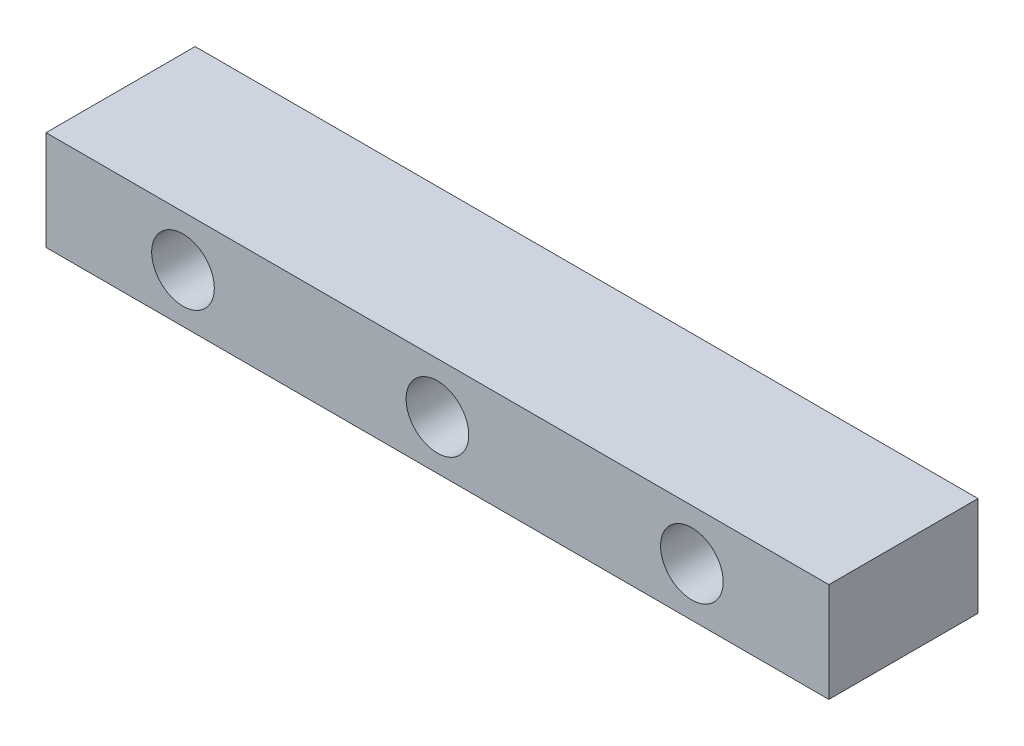
ISO-10303-21;
HEADER;
FILE_DESCRIPTION(('STEP AP214'),'2;1');
FILE_NAME('part.step','',(''),(''),'','','');
FILE_SCHEMA(('AUTOMOTIVE_DESIGN { 1 0 10303 214 1 1 1 1 }'));
ENDSEC;
DATA;
#1=APPLICATION_CONTEXT('core data for automotive mechanical design processes');
#2=APPLICATION_PROTOCOL_DEFINITION('international standard','automotive_design',2000,#1);
#3=PRODUCT_CONTEXT('',#1,'mechanical');
#4=PRODUCT('Part','Part','',(#3));
#5=PRODUCT_RELATED_PRODUCT_CATEGORY('part','',(#4));
#6=PRODUCT_DEFINITION_FORMATION('','',#4);
#7=PRODUCT_DEFINITION_CONTEXT('part definition',#1,'design');
#8=PRODUCT_DEFINITION('design','',#6,#7);
#9=PRODUCT_DEFINITION_SHAPE('','',#8);
#10=(LENGTH_UNIT() NAMED_UNIT(*) SI_UNIT(.MILLI.,.METRE.));
#11=(NAMED_UNIT(*) PLANE_ANGLE_UNIT() SI_UNIT($,.RADIAN.));
#12=(NAMED_UNIT(*) SI_UNIT($,.STERADIAN.) SOLID_ANGLE_UNIT());
#13=UNCERTAINTY_MEASURE_WITH_UNIT(LENGTH_MEASURE(1.E-05),#10,'distance_accuracy_value','');
#14=(GEOMETRIC_REPRESENTATION_CONTEXT(3) GLOBAL_UNCERTAINTY_ASSIGNED_CONTEXT((#13)) GLOBAL_UNIT_ASSIGNED_CONTEXT((#10,
#11,#12)) REPRESENTATION_CONTEXT('',''));
#15=CARTESIAN_POINT('',(0.,0.,0.));
#16=DIRECTION('',(0.,0.,1.));
#17=DIRECTION('',(1.,0.,0.));
#18=AXIS2_PLACEMENT_3D('',#15,#16,#17);
#19=CARTESIAN_POINT('',(0.,50.8,0.));
#20=DIRECTION('',(1.,0.,0.));
#21=DIRECTION('',(0.,0.,-1.));
#22=AXIS2_PLACEMENT_3D('',#19,#20,#21);
#23=PLANE('',#22);
#24=DIRECTION('',(0.,0.,1.));
#25=VECTOR('',#24,1.);
#26=CARTESIAN_POINT('',(0.,0.,0.));
#27=LINE('',#26,#25);
#28=CARTESIAN_POINT('',(0.,0.,-76.2));
#29=VERTEX_POINT('',#28);
#30=CARTESIAN_POINT('',(0.,0.,0.));
#31=VERTEX_POINT('',#30);
#32=EDGE_CURVE('E96',#29,#31,#27,.T.);
#33=ORIENTED_EDGE('',*,*,#32,.T.);
#34=DIRECTION('',(0.,-1.,0.));
#35=VECTOR('',#34,1.);
#36=CARTESIAN_POINT('',(0.,50.8,0.));
#37=LINE('',#36,#35);
#38=CARTESIAN_POINT('',(0.,50.8,0.));
#39=VERTEX_POINT('',#38);
#40=EDGE_CURVE('E11',#39,#31,#37,.T.);
#41=ORIENTED_EDGE('',*,*,#40,.F.);
#42=DIRECTION('',(0.,0.,1.));
#43=VECTOR('',#42,1.);
#44=CARTESIAN_POINT('',(0.,50.8,0.));
#45=LINE('',#44,#43);
#46=CARTESIAN_POINT('',(0.,50.8,-76.2));
#47=VERTEX_POINT('',#46);
#48=EDGE_CURVE('E84',#47,#39,#45,.T.);
#49=ORIENTED_EDGE('',*,*,#48,.F.);
#50=DIRECTION('',(0.,-1.,0.));
#51=VECTOR('',#50,1.);
#52=CARTESIAN_POINT('',(0.,50.8,-76.2));
#53=LINE('',#52,#51);
#54=EDGE_CURVE('E92',#47,#29,#53,.T.);
#55=ORIENTED_EDGE('',*,*,#54,.T.);
#56=EDGE_LOOP('',(#33,#41,#49,#55));
#57=FACE_BOUND('',#56,.T.);
#58=ADVANCED_FACE('F33',(#57),#23,.F.);
#59=CARTESIAN_POINT('',(0.,50.8,0.));
#60=DIRECTION('',(0.,0.,-1.));
#61=DIRECTION('',(-1.,0.,0.));
#62=AXIS2_PLACEMENT_3D('',#59,#60,#61);
#63=PLANE('',#62);
#64=CARTESIAN_POINT('',(330.,25.,0.));
#65=DIRECTION('',(0.,0.,1.));
#66=DIRECTION('',(1.,0.,0.));
#67=AXIS2_PLACEMENT_3D('',#64,#65,#66);
#68=CIRCLE('',#67,16.);
#69=CARTESIAN_POINT('',(346.,25.,0.));
#70=VERTEX_POINT('',#69);
#71=EDGE_CURVE('E119',#70,#70,#68,.T.);
#72=ORIENTED_EDGE('',*,*,#71,.F.);
#73=EDGE_LOOP('',(#72));
#74=FACE_BOUND('',#73,.T.);
#75=CARTESIAN_POINT('',(200.,25.,0.));
#76=DIRECTION('',(0.,0.,1.));
#77=DIRECTION('',(1.,0.,0.));
#78=AXIS2_PLACEMENT_3D('',#75,#76,#77);
#79=CIRCLE('',#78,16.);
#80=CARTESIAN_POINT('',(216.,25.,0.));
#81=VERTEX_POINT('',#80);
#82=EDGE_CURVE('E113',#81,#81,#79,.T.);
#83=ORIENTED_EDGE('',*,*,#82,.F.);
#84=EDGE_LOOP('',(#83));
#85=FACE_BOUND('',#84,.T.);
#86=CARTESIAN_POINT('',(70.,25.,0.));
#87=DIRECTION('',(0.,0.,1.));
#88=DIRECTION('',(1.,0.,0.));
#89=AXIS2_PLACEMENT_3D('',#86,#87,#88);
#90=CIRCLE('',#89,16.);
#91=CARTESIAN_POINT('',(86.,25.,0.));
#92=VERTEX_POINT('',#91);
#93=EDGE_CURVE('E110',#92,#92,#90,.T.);
#94=ORIENTED_EDGE('',*,*,#93,.F.);
#95=EDGE_LOOP('',(#94));
#96=FACE_BOUND('',#95,.T.);
#97=DIRECTION('',(1.,0.,0.));
#98=VECTOR('',#97,1.);
#99=CARTESIAN_POINT('',(0.,0.,0.));
#100=LINE('',#99,#98);
#101=CARTESIAN_POINT('',(400.,0.,0.));
#102=VERTEX_POINT('',#101);
#103=EDGE_CURVE('E88',#31,#102,#100,.T.);
#104=ORIENTED_EDGE('',*,*,#103,.T.);
#105=DIRECTION('',(0.,-1.,0.));
#106=VECTOR('',#105,1.);
#107=CARTESIAN_POINT('',(400.,50.8,0.));
#108=LINE('',#107,#106);
#109=CARTESIAN_POINT('',(400.,50.8,0.));
#110=VERTEX_POINT('',#109);
#111=EDGE_CURVE('E41',#110,#102,#108,.T.);
#112=ORIENTED_EDGE('',*,*,#111,.F.);
#113=DIRECTION('',(1.,0.,0.));
#114=VECTOR('',#113,1.);
#115=CARTESIAN_POINT('',(0.,50.8,0.));
#116=LINE('',#115,#114);
#117=EDGE_CURVE('E79',#39,#110,#116,.T.);
#118=ORIENTED_EDGE('',*,*,#117,.F.);
#119=ORIENTED_EDGE('',*,*,#40,.T.);
#120=EDGE_LOOP('',(#104,#112,#118,#119));
#121=FACE_BOUND('',#120,.T.);
#122=ADVANCED_FACE('F87',(#74,#85,#96,#121),#63,.F.);
#123=CARTESIAN_POINT('',(400.,50.8,0.));
#124=DIRECTION('',(-1.,0.,0.));
#125=DIRECTION('',(0.,0.,1.));
#126=AXIS2_PLACEMENT_3D('',#123,#124,#125);
#127=PLANE('',#126);
#128=DIRECTION('',(0.,0.,-1.));
#129=VECTOR('',#128,1.);
#130=CARTESIAN_POINT('',(400.,0.,0.));
#131=LINE('',#130,#129);
#132=CARTESIAN_POINT('',(400.,0.,-76.2));
#133=VERTEX_POINT('',#132);
#134=EDGE_CURVE('E66',#102,#133,#131,.T.);
#135=ORIENTED_EDGE('',*,*,#134,.T.);
#136=DIRECTION('',(0.,-1.,0.));
#137=VECTOR('',#136,1.);
#138=CARTESIAN_POINT('',(400.,50.8,-76.2));
#139=LINE('',#138,#137);
#140=CARTESIAN_POINT('',(400.,50.8,-76.2));
#141=VERTEX_POINT('',#140);
#142=EDGE_CURVE('E89',#141,#133,#139,.T.);
#143=ORIENTED_EDGE('',*,*,#142,.F.);
#144=DIRECTION('',(0.,0.,-1.));
#145=VECTOR('',#144,1.);
#146=CARTESIAN_POINT('',(400.,50.8,0.));
#147=LINE('',#146,#145);
#148=EDGE_CURVE('E82',#110,#141,#147,.T.);
#149=ORIENTED_EDGE('',*,*,#148,.F.);
#150=ORIENTED_EDGE('',*,*,#111,.T.);
#151=EDGE_LOOP('',(#135,#143,#149,#150));
#152=FACE_BOUND('',#151,.T.);
#153=ADVANCED_FACE('F90',(#152),#127,.F.);
#154=CARTESIAN_POINT('',(0.,50.8,-76.2));
#155=DIRECTION('',(0.,0.,1.));
#156=DIRECTION('',(1.,0.,0.));
#157=AXIS2_PLACEMENT_3D('',#154,#155,#156);
#158=PLANE('',#157);
#159=CARTESIAN_POINT('',(330.,25.,-76.2));
#160=DIRECTION('',(0.,0.,1.));
#161=DIRECTION('',(1.,0.,0.));
#162=AXIS2_PLACEMENT_3D('',#159,#160,#161);
#163=CIRCLE('',#162,16.);
#164=CARTESIAN_POINT('',(346.,25.,-76.2));
#165=VERTEX_POINT('',#164);
#166=EDGE_CURVE('E122',#165,#165,#163,.T.);
#167=ORIENTED_EDGE('',*,*,#166,.T.);
#168=EDGE_LOOP('',(#167));
#169=FACE_BOUND('',#168,.T.);
#170=CARTESIAN_POINT('',(200.,25.,-76.2));
#171=DIRECTION('',(0.,0.,1.));
#172=DIRECTION('',(1.,0.,0.));
#173=AXIS2_PLACEMENT_3D('',#170,#171,#172);
#174=CIRCLE('',#173,16.);
#175=CARTESIAN_POINT('',(216.,25.,-76.2));
#176=VERTEX_POINT('',#175);
#177=EDGE_CURVE('E116',#176,#176,#174,.T.);
#178=ORIENTED_EDGE('',*,*,#177,.T.);
#179=EDGE_LOOP('',(#178));
#180=FACE_BOUND('',#179,.T.);
#181=CARTESIAN_POINT('',(70.,25.,-76.2));
#182=DIRECTION('',(0.,0.,1.));
#183=DIRECTION('',(1.,0.,0.));
#184=AXIS2_PLACEMENT_3D('',#181,#182,#183);
#185=CIRCLE('',#184,16.);
#186=CARTESIAN_POINT('',(86.,25.,-76.2));
#187=VERTEX_POINT('',#186);
#188=EDGE_CURVE('E99',#187,#187,#185,.T.);
#189=ORIENTED_EDGE('',*,*,#188,.T.);
#190=EDGE_LOOP('',(#189));
#191=FACE_BOUND('',#190,.T.);
#192=DIRECTION('',(-1.,0.,0.));
#193=VECTOR('',#192,1.);
#194=CARTESIAN_POINT('',(0.,0.,-76.2));
#195=LINE('',#194,#193);
#196=EDGE_CURVE('E72',#133,#29,#195,.T.);
#197=ORIENTED_EDGE('',*,*,#196,.T.);
#198=ORIENTED_EDGE('',*,*,#54,.F.);
#199=DIRECTION('',(-1.,0.,0.));
#200=VECTOR('',#199,1.);
#201=CARTESIAN_POINT('',(0.,50.8,-76.2));
#202=LINE('',#201,#200);
#203=EDGE_CURVE('E49',#141,#47,#202,.T.);
#204=ORIENTED_EDGE('',*,*,#203,.F.);
#205=ORIENTED_EDGE('',*,*,#142,.T.);
#206=EDGE_LOOP('',(#197,#198,#204,#205));
#207=FACE_BOUND('',#206,.T.);
#208=ADVANCED_FACE('F104',(#169,#180,#191,#207),#158,.F.);
#209=CARTESIAN_POINT('',(0.,50.8,-76.2));
#210=DIRECTION('',(0.,-1.,0.));
#211=DIRECTION('',(0.,0.,-1.));
#212=AXIS2_PLACEMENT_3D('',#209,#210,#211);
#213=PLANE('',#212);
#214=ORIENTED_EDGE('',*,*,#48,.T.);
#215=ORIENTED_EDGE('',*,*,#117,.T.);
#216=ORIENTED_EDGE('',*,*,#148,.T.);
#217=ORIENTED_EDGE('',*,*,#203,.T.);
#218=EDGE_LOOP('',(#214,#215,#216,#217));
#219=FACE_BOUND('',#218,.T.);
#220=ADVANCED_FACE('F80',(#219),#213,.F.);
#221=CARTESIAN_POINT('',(0.,0.,-76.2));
#222=DIRECTION('',(0.,-1.,0.));
#223=DIRECTION('',(0.,0.,-1.));
#224=AXIS2_PLACEMENT_3D('',#221,#222,#223);
#225=PLANE('',#224);
#226=ORIENTED_EDGE('',*,*,#32,.F.);
#227=ORIENTED_EDGE('',*,*,#196,.F.);
#228=ORIENTED_EDGE('',*,*,#134,.F.);
#229=ORIENTED_EDGE('',*,*,#103,.F.);
#230=EDGE_LOOP('',(#226,#227,#228,#229));
#231=FACE_BOUND('',#230,.T.);
#232=ADVANCED_FACE('F107',(#231),#225,.T.);
#233=CARTESIAN_POINT('',(70.,25.,-76.2));
#234=DIRECTION('',(0.,0.,1.));
#235=DIRECTION('',(1.,0.,0.));
#236=AXIS2_PLACEMENT_3D('',#233,#234,#235);
#237=CYLINDRICAL_SURFACE('',#236,16.);
#238=ORIENTED_EDGE('',*,*,#188,.F.);
#239=EDGE_LOOP('',(#238));
#240=FACE_BOUND('',#239,.T.);
#241=ORIENTED_EDGE('',*,*,#93,.T.);
#242=EDGE_LOOP('',(#241));
#243=FACE_BOUND('',#242,.T.);
#244=ADVANCED_FACE('F136',(#240,#243),#237,.F.);
#245=CARTESIAN_POINT('',(200.,25.,-76.2));
#246=DIRECTION('',(0.,0.,1.));
#247=DIRECTION('',(1.,0.,0.));
#248=AXIS2_PLACEMENT_3D('',#245,#246,#247);
#249=CYLINDRICAL_SURFACE('',#248,16.);
#250=ORIENTED_EDGE('',*,*,#177,.F.);
#251=EDGE_LOOP('',(#250));
#252=FACE_BOUND('',#251,.T.);
#253=ORIENTED_EDGE('',*,*,#82,.T.);
#254=EDGE_LOOP('',(#253));
#255=FACE_BOUND('',#254,.T.);
#256=ADVANCED_FACE('F138',(#252,#255),#249,.F.);
#257=CARTESIAN_POINT('',(330.,25.,-76.2));
#258=DIRECTION('',(0.,0.,1.));
#259=DIRECTION('',(1.,0.,0.));
#260=AXIS2_PLACEMENT_3D('',#257,#258,#259);
#261=CYLINDRICAL_SURFACE('',#260,16.);
#262=ORIENTED_EDGE('',*,*,#166,.F.);
#263=EDGE_LOOP('',(#262));
#264=FACE_BOUND('',#263,.T.);
#265=ORIENTED_EDGE('',*,*,#71,.T.);
#266=EDGE_LOOP('',(#265));
#267=FACE_BOUND('',#266,.T.);
#268=ADVANCED_FACE('F128',(#264,#267),#261,.F.);
#269=CLOSED_SHELL('',(#58,#122,#153,#208,#220,#232,#244,#256,#268));
#270=MANIFOLD_SOLID_BREP('B2',#269);
#271=ADVANCED_BREP_SHAPE_REPRESENTATION('',(#18,#270),#14);
#272=SHAPE_DEFINITION_REPRESENTATION(#9,#271);
ENDSEC;
END-ISO-10303-21;
